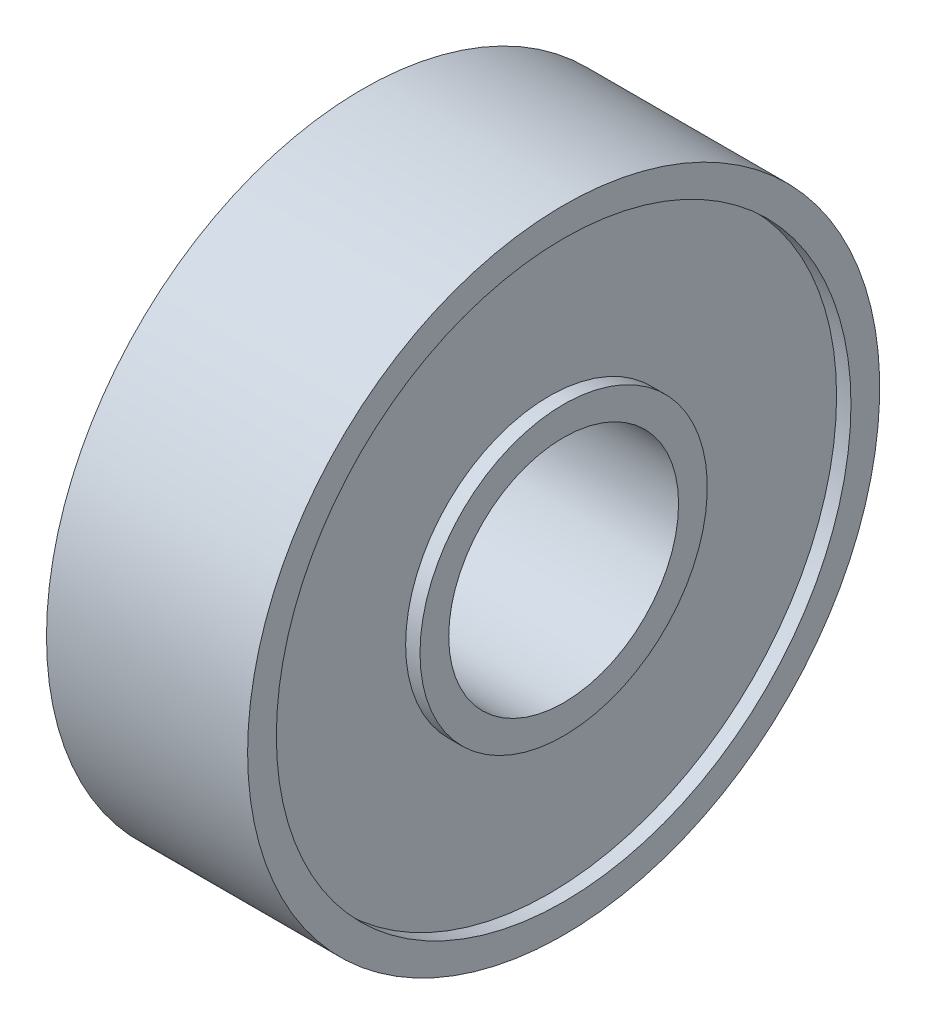
ISO-10303-21;
HEADER;
FILE_DESCRIPTION(('STEP AP214'),'2;1');
FILE_NAME('part.step','',(''),(''),'','','');
FILE_SCHEMA(('AUTOMOTIVE_DESIGN { 1 0 10303 214 1 1 1 1 }'));
ENDSEC;
DATA;
#1=APPLICATION_CONTEXT('core data for automotive mechanical design processes');
#2=APPLICATION_PROTOCOL_DEFINITION('international standard','automotive_design',2000,#1);
#3=PRODUCT_CONTEXT('',#1,'mechanical');
#4=PRODUCT('Part','Part','',(#3));
#5=PRODUCT_RELATED_PRODUCT_CATEGORY('part','',(#4));
#6=PRODUCT_DEFINITION_FORMATION('','',#4);
#7=PRODUCT_DEFINITION_CONTEXT('part definition',#1,'design');
#8=PRODUCT_DEFINITION('design','',#6,#7);
#9=PRODUCT_DEFINITION_SHAPE('','',#8);
#10=(LENGTH_UNIT() NAMED_UNIT(*) SI_UNIT(.MILLI.,.METRE.));
#11=(NAMED_UNIT(*) PLANE_ANGLE_UNIT() SI_UNIT($,.RADIAN.));
#12=(NAMED_UNIT(*) SI_UNIT($,.STERADIAN.) SOLID_ANGLE_UNIT());
#13=UNCERTAINTY_MEASURE_WITH_UNIT(LENGTH_MEASURE(1.E-05),#10,'distance_accuracy_value','');
#14=(GEOMETRIC_REPRESENTATION_CONTEXT(3) GLOBAL_UNCERTAINTY_ASSIGNED_CONTEXT((#13)) GLOBAL_UNIT_ASSIGNED_CONTEXT((#10,
#11,#12)) REPRESENTATION_CONTEXT('',''));
#15=CARTESIAN_POINT('',(0.,0.,0.));
#16=DIRECTION('',(0.,0.,1.));
#17=DIRECTION('',(1.,0.,0.));
#18=AXIS2_PLACEMENT_3D('',#15,#16,#17);
#19=CARTESIAN_POINT('',(-3.5,11.,0.));
#20=DIRECTION('',(1.,0.,0.));
#21=DIRECTION('',(0.,0.,-1.));
#22=AXIS2_PLACEMENT_3D('',#19,#20,#21);
#23=PLANE('',#22);
#24=CARTESIAN_POINT('',(-3.5,0.,0.));
#25=DIRECTION('',(-1.,0.,0.));
#26=DIRECTION('',(0.,0.,1.));
#27=AXIS2_PLACEMENT_3D('',#24,#25,#26);
#28=CIRCLE('',#27,10.);
#29=CARTESIAN_POINT('',(-3.5,0.,10.));
#30=VERTEX_POINT('',#29);
#31=EDGE_CURVE('E10',#30,#30,#28,.T.);
#32=ORIENTED_EDGE('',*,*,#31,.F.);
#33=EDGE_LOOP('',(#32));
#34=FACE_BOUND('',#33,.T.);
#35=CARTESIAN_POINT('',(-3.5,0.,0.));
#36=DIRECTION('',(-1.,0.,0.));
#37=DIRECTION('',(0.,0.,1.));
#38=AXIS2_PLACEMENT_3D('',#35,#36,#37);
#39=CIRCLE('',#38,11.);
#40=CARTESIAN_POINT('',(-3.5,0.,11.));
#41=VERTEX_POINT('',#40);
#42=EDGE_CURVE('E69',#41,#41,#39,.T.);
#43=ORIENTED_EDGE('',*,*,#42,.T.);
#44=EDGE_LOOP('',(#43));
#45=FACE_BOUND('',#44,.T.);
#46=ADVANCED_FACE('F29',(#34,#45),#23,.F.);
#47=CARTESIAN_POINT('',(-3.35443145763747,0.,0.));
#48=DIRECTION('',(-1.,0.,0.));
#49=DIRECTION('',(0.,0.,1.));
#50=AXIS2_PLACEMENT_3D('',#47,#48,#49);
#51=CYLINDRICAL_SURFACE('',#50,10.);
#52=CARTESIAN_POINT('',(-3.,0.,0.));
#53=DIRECTION('',(-1.,0.,0.));
#54=DIRECTION('',(0.,0.,1.));
#55=AXIS2_PLACEMENT_3D('',#52,#53,#54);
#56=CIRCLE('',#55,10.);
#57=CARTESIAN_POINT('',(-3.,0.,10.));
#58=VERTEX_POINT('',#57);
#59=EDGE_CURVE('E35',#58,#58,#56,.T.);
#60=ORIENTED_EDGE('',*,*,#59,.F.);
#61=EDGE_LOOP('',(#60));
#62=FACE_BOUND('',#61,.T.);
#63=ORIENTED_EDGE('',*,*,#31,.T.);
#64=EDGE_LOOP('',(#63));
#65=FACE_BOUND('',#64,.T.);
#66=ADVANCED_FACE('F130',(#62,#65),#51,.F.);
#67=CARTESIAN_POINT('',(-3.,10.,0.));
#68=DIRECTION('',(1.,0.,0.));
#69=DIRECTION('',(0.,0.,-1.));
#70=AXIS2_PLACEMENT_3D('',#67,#68,#69);
#71=PLANE('',#70);
#72=CARTESIAN_POINT('',(-3.,0.,0.));
#73=DIRECTION('',(-1.,0.,0.));
#74=DIRECTION('',(0.,0.,1.));
#75=AXIS2_PLACEMENT_3D('',#72,#73,#74);
#76=CIRCLE('',#75,5.);
#77=CARTESIAN_POINT('',(-3.,0.,5.));
#78=VERTEX_POINT('',#77);
#79=EDGE_CURVE('E39',#78,#78,#76,.T.);
#80=ORIENTED_EDGE('',*,*,#79,.F.);
#81=EDGE_LOOP('',(#80));
#82=FACE_BOUND('',#81,.T.);
#83=ORIENTED_EDGE('',*,*,#59,.T.);
#84=EDGE_LOOP('',(#83));
#85=FACE_BOUND('',#84,.T.);
#86=ADVANCED_FACE('F125',(#82,#85),#71,.F.);
#87=CARTESIAN_POINT('',(-3.35443145763747,0.,0.));
#88=DIRECTION('',(-1.,0.,0.));
#89=DIRECTION('',(0.,0.,1.));
#90=AXIS2_PLACEMENT_3D('',#87,#88,#89);
#91=CYLINDRICAL_SURFACE('',#90,5.);
#92=CARTESIAN_POINT('',(-3.5,0.,0.));
#93=DIRECTION('',(-1.,0.,0.));
#94=DIRECTION('',(0.,0.,1.));
#95=AXIS2_PLACEMENT_3D('',#92,#93,#94);
#96=CIRCLE('',#95,5.);
#97=CARTESIAN_POINT('',(-3.5,0.,5.));
#98=VERTEX_POINT('',#97);
#99=EDGE_CURVE('E43',#98,#98,#96,.T.);
#100=ORIENTED_EDGE('',*,*,#99,.F.);
#101=EDGE_LOOP('',(#100));
#102=FACE_BOUND('',#101,.T.);
#103=ORIENTED_EDGE('',*,*,#79,.T.);
#104=EDGE_LOOP('',(#103));
#105=FACE_BOUND('',#104,.T.);
#106=ADVANCED_FACE('F119',(#102,#105),#91,.T.);
#107=CARTESIAN_POINT('',(-3.5,5.,0.));
#108=DIRECTION('',(1.,0.,0.));
#109=DIRECTION('',(0.,0.,-1.));
#110=AXIS2_PLACEMENT_3D('',#107,#108,#109);
#111=PLANE('',#110);
#112=CARTESIAN_POINT('',(-3.5,0.,0.));
#113=DIRECTION('',(-1.,0.,0.));
#114=DIRECTION('',(0.,0.,1.));
#115=AXIS2_PLACEMENT_3D('',#112,#113,#114);
#116=CIRCLE('',#115,4.);
#117=CARTESIAN_POINT('',(-3.5,0.,4.));
#118=VERTEX_POINT('',#117);
#119=EDGE_CURVE('E48',#118,#118,#116,.T.);
#120=ORIENTED_EDGE('',*,*,#119,.F.);
#121=EDGE_LOOP('',(#120));
#122=FACE_BOUND('',#121,.T.);
#123=ORIENTED_EDGE('',*,*,#99,.T.);
#124=EDGE_LOOP('',(#123));
#125=FACE_BOUND('',#124,.T.);
#126=ADVANCED_FACE('F113',(#122,#125),#111,.F.);
#127=CARTESIAN_POINT('',(-3.35443145763747,0.,0.));
#128=DIRECTION('',(-1.,0.,0.));
#129=DIRECTION('',(0.,0.,1.));
#130=AXIS2_PLACEMENT_3D('',#127,#128,#129);
#131=CYLINDRICAL_SURFACE('',#130,4.);
#132=CARTESIAN_POINT('',(3.5,0.,0.));
#133=DIRECTION('',(-1.,0.,0.));
#134=DIRECTION('',(0.,0.,1.));
#135=AXIS2_PLACEMENT_3D('',#132,#133,#134);
#136=CIRCLE('',#135,4.);
#137=CARTESIAN_POINT('',(3.5,0.,4.));
#138=VERTEX_POINT('',#137);
#139=EDGE_CURVE('E51',#138,#138,#136,.T.);
#140=ORIENTED_EDGE('',*,*,#139,.F.);
#141=EDGE_LOOP('',(#140));
#142=FACE_BOUND('',#141,.T.);
#143=ORIENTED_EDGE('',*,*,#119,.T.);
#144=EDGE_LOOP('',(#143));
#145=FACE_BOUND('',#144,.T.);
#146=ADVANCED_FACE('F107',(#142,#145),#131,.F.);
#147=CARTESIAN_POINT('',(3.5,5.,0.));
#148=DIRECTION('',(-1.,0.,0.));
#149=DIRECTION('',(0.,0.,1.));
#150=AXIS2_PLACEMENT_3D('',#147,#148,#149);
#151=PLANE('',#150);
#152=CARTESIAN_POINT('',(3.5,0.,0.));
#153=DIRECTION('',(-1.,0.,0.));
#154=DIRECTION('',(0.,0.,1.));
#155=AXIS2_PLACEMENT_3D('',#152,#153,#154);
#156=CIRCLE('',#155,5.);
#157=CARTESIAN_POINT('',(3.5,0.,5.));
#158=VERTEX_POINT('',#157);
#159=EDGE_CURVE('E54',#158,#158,#156,.T.);
#160=ORIENTED_EDGE('',*,*,#159,.F.);
#161=EDGE_LOOP('',(#160));
#162=FACE_BOUND('',#161,.T.);
#163=ORIENTED_EDGE('',*,*,#139,.T.);
#164=EDGE_LOOP('',(#163));
#165=FACE_BOUND('',#164,.T.);
#166=ADVANCED_FACE('F101',(#162,#165),#151,.F.);
#167=CARTESIAN_POINT('',(-3.35443145763747,0.,0.));
#168=DIRECTION('',(-1.,0.,0.));
#169=DIRECTION('',(0.,0.,1.));
#170=AXIS2_PLACEMENT_3D('',#167,#168,#169);
#171=CYLINDRICAL_SURFACE('',#170,5.);
#172=CARTESIAN_POINT('',(3.,0.,0.));
#173=DIRECTION('',(-1.,0.,0.));
#174=DIRECTION('',(0.,0.,1.));
#175=AXIS2_PLACEMENT_3D('',#172,#173,#174);
#176=CIRCLE('',#175,5.);
#177=CARTESIAN_POINT('',(3.,0.,5.));
#178=VERTEX_POINT('',#177);
#179=EDGE_CURVE('E57',#178,#178,#176,.T.);
#180=ORIENTED_EDGE('',*,*,#179,.F.);
#181=EDGE_LOOP('',(#180));
#182=FACE_BOUND('',#181,.T.);
#183=ORIENTED_EDGE('',*,*,#159,.T.);
#184=EDGE_LOOP('',(#183));
#185=FACE_BOUND('',#184,.T.);
#186=ADVANCED_FACE('F95',(#182,#185),#171,.T.);
#187=CARTESIAN_POINT('',(3.,5.,0.));
#188=DIRECTION('',(-1.,0.,0.));
#189=DIRECTION('',(0.,0.,1.));
#190=AXIS2_PLACEMENT_3D('',#187,#188,#189);
#191=PLANE('',#190);
#192=CARTESIAN_POINT('',(3.,0.,0.));
#193=DIRECTION('',(-1.,0.,0.));
#194=DIRECTION('',(0.,0.,1.));
#195=AXIS2_PLACEMENT_3D('',#192,#193,#194);
#196=CIRCLE('',#195,10.);
#197=CARTESIAN_POINT('',(3.,0.,10.));
#198=VERTEX_POINT('',#197);
#199=EDGE_CURVE('E60',#198,#198,#196,.T.);
#200=ORIENTED_EDGE('',*,*,#199,.F.);
#201=EDGE_LOOP('',(#200));
#202=FACE_BOUND('',#201,.T.);
#203=ORIENTED_EDGE('',*,*,#179,.T.);
#204=EDGE_LOOP('',(#203));
#205=FACE_BOUND('',#204,.T.);
#206=ADVANCED_FACE('F89',(#202,#205),#191,.F.);
#207=CARTESIAN_POINT('',(-3.35443145763747,0.,0.));
#208=DIRECTION('',(-1.,0.,0.));
#209=DIRECTION('',(0.,0.,1.));
#210=AXIS2_PLACEMENT_3D('',#207,#208,#209);
#211=CYLINDRICAL_SURFACE('',#210,10.);
#212=CARTESIAN_POINT('',(3.5,0.,0.));
#213=DIRECTION('',(-1.,0.,0.));
#214=DIRECTION('',(0.,0.,1.));
#215=AXIS2_PLACEMENT_3D('',#212,#213,#214);
#216=CIRCLE('',#215,10.);
#217=CARTESIAN_POINT('',(3.5,0.,10.));
#218=VERTEX_POINT('',#217);
#219=EDGE_CURVE('E63',#218,#218,#216,.T.);
#220=ORIENTED_EDGE('',*,*,#219,.F.);
#221=EDGE_LOOP('',(#220));
#222=FACE_BOUND('',#221,.T.);
#223=ORIENTED_EDGE('',*,*,#199,.T.);
#224=EDGE_LOOP('',(#223));
#225=FACE_BOUND('',#224,.T.);
#226=ADVANCED_FACE('F83',(#222,#225),#211,.F.);
#227=CARTESIAN_POINT('',(3.5,11.,0.));
#228=DIRECTION('',(-1.,0.,0.));
#229=DIRECTION('',(0.,0.,1.));
#230=AXIS2_PLACEMENT_3D('',#227,#228,#229);
#231=PLANE('',#230);
#232=CARTESIAN_POINT('',(3.5,0.,0.));
#233=DIRECTION('',(-1.,0.,0.));
#234=DIRECTION('',(0.,0.,1.));
#235=AXIS2_PLACEMENT_3D('',#232,#233,#234);
#236=CIRCLE('',#235,11.);
#237=CARTESIAN_POINT('',(3.5,0.,11.));
#238=VERTEX_POINT('',#237);
#239=EDGE_CURVE('E66',#238,#238,#236,.T.);
#240=ORIENTED_EDGE('',*,*,#239,.F.);
#241=EDGE_LOOP('',(#240));
#242=FACE_BOUND('',#241,.T.);
#243=ORIENTED_EDGE('',*,*,#219,.T.);
#244=EDGE_LOOP('',(#243));
#245=FACE_BOUND('',#244,.T.);
#246=ADVANCED_FACE('F77',(#242,#245),#231,.F.);
#247=CARTESIAN_POINT('',(-3.35443145763747,0.,0.));
#248=DIRECTION('',(-1.,0.,0.));
#249=DIRECTION('',(0.,0.,1.));
#250=AXIS2_PLACEMENT_3D('',#247,#248,#249);
#251=CYLINDRICAL_SURFACE('',#250,11.);
#252=ORIENTED_EDGE('',*,*,#42,.F.);
#253=EDGE_LOOP('',(#252));
#254=FACE_BOUND('',#253,.T.);
#255=ORIENTED_EDGE('',*,*,#239,.T.);
#256=EDGE_LOOP('',(#255));
#257=FACE_BOUND('',#256,.T.);
#258=ADVANCED_FACE('F74',(#254,#257),#251,.T.);
#259=CLOSED_SHELL('',(#46,#66,#86,#106,#126,#146,#166,#186,#206,#226,#246,#258));
#260=MANIFOLD_SOLID_BREP('B2',#259);
#261=ADVANCED_BREP_SHAPE_REPRESENTATION('',(#18,#260),#14);
#262=SHAPE_DEFINITION_REPRESENTATION(#9,#261);
ENDSEC;
END-ISO-10303-21;
